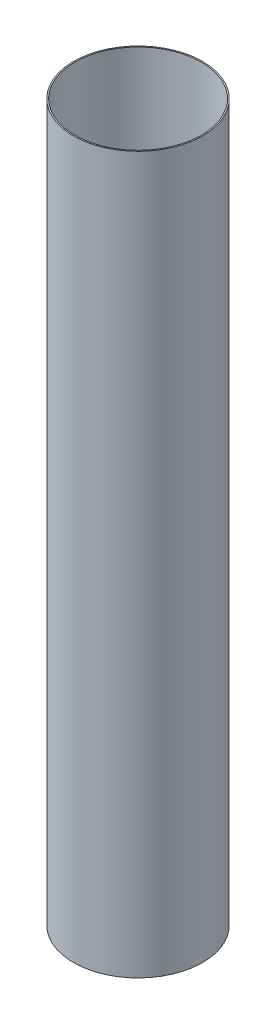
ISO-10303-21;
HEADER;
FILE_DESCRIPTION(('STEP AP214'),'2;1');
FILE_NAME('part.step','',(''),(''),'','','');
FILE_SCHEMA(('AUTOMOTIVE_DESIGN { 1 0 10303 214 1 1 1 1 }'));
ENDSEC;
DATA;
#1=APPLICATION_CONTEXT('core data for automotive mechanical design processes');
#2=APPLICATION_PROTOCOL_DEFINITION('international standard','automotive_design',2000,#1);
#3=PRODUCT_CONTEXT('',#1,'mechanical');
#4=PRODUCT('Part','Part','',(#3));
#5=PRODUCT_RELATED_PRODUCT_CATEGORY('part','',(#4));
#6=PRODUCT_DEFINITION_FORMATION('','',#4);
#7=PRODUCT_DEFINITION_CONTEXT('part definition',#1,'design');
#8=PRODUCT_DEFINITION('design','',#6,#7);
#9=PRODUCT_DEFINITION_SHAPE('','',#8);
#10=(LENGTH_UNIT() NAMED_UNIT(*) SI_UNIT(.MILLI.,.METRE.));
#11=(NAMED_UNIT(*) PLANE_ANGLE_UNIT() SI_UNIT($,.RADIAN.));
#12=(NAMED_UNIT(*) SI_UNIT($,.STERADIAN.) SOLID_ANGLE_UNIT());
#13=UNCERTAINTY_MEASURE_WITH_UNIT(LENGTH_MEASURE(1.E-05),#10,'distance_accuracy_value','');
#14=(GEOMETRIC_REPRESENTATION_CONTEXT(3) GLOBAL_UNCERTAINTY_ASSIGNED_CONTEXT((#13)) GLOBAL_UNIT_ASSIGNED_CONTEXT((#10,
#11,#12)) REPRESENTATION_CONTEXT('',''));
#15=CARTESIAN_POINT('',(0.,0.,0.));
#16=DIRECTION('',(0.,0.,1.));
#17=DIRECTION('',(1.,0.,0.));
#18=AXIS2_PLACEMENT_3D('',#15,#16,#17);
#19=CARTESIAN_POINT('',(0.,574.5988,0.));
#20=DIRECTION('',(0.,-1.,0.));
#21=DIRECTION('',(0.,0.,-1.));
#22=AXIS2_PLACEMENT_3D('',#19,#20,#21);
#23=CYLINDRICAL_SURFACE('',#22,50.8);
#24=CARTESIAN_POINT('',(0.,0.,0.));
#25=DIRECTION('',(0.,-1.,0.));
#26=DIRECTION('',(0.,0.,-1.));
#27=AXIS2_PLACEMENT_3D('',#24,#25,#26);
#28=CIRCLE('',#27,50.8);
#29=CARTESIAN_POINT('',(0.,0.,-50.8));
#30=VERTEX_POINT('',#29);
#31=EDGE_CURVE('E19',#30,#30,#28,.T.);
#32=ORIENTED_EDGE('',*,*,#31,.T.);
#33=EDGE_LOOP('',(#32));
#34=FACE_BOUND('',#33,.T.);
#35=CARTESIAN_POINT('',(0.,574.5988,0.));
#36=DIRECTION('',(0.,-1.,0.));
#37=DIRECTION('',(0.,0.,-1.));
#38=AXIS2_PLACEMENT_3D('',#35,#36,#37);
#39=CIRCLE('',#38,50.8);
#40=CARTESIAN_POINT('',(0.,574.5988,-50.8));
#41=VERTEX_POINT('',#40);
#42=EDGE_CURVE('E28',#41,#41,#39,.T.);
#43=ORIENTED_EDGE('',*,*,#42,.F.);
#44=EDGE_LOOP('',(#43));
#45=FACE_BOUND('',#44,.T.);
#46=ADVANCED_FACE('F15',(#34,#45),#23,.F.);
#47=CARTESIAN_POINT('',(-52.437792,0.,-52.437792));
#48=DIRECTION('',(0.,1.,0.));
#49=DIRECTION('',(0.,0.,1.));
#50=AXIS2_PLACEMENT_3D('',#47,#48,#49);
#51=PLANE('',#50);
#52=ORIENTED_EDGE('',*,*,#31,.F.);
#53=EDGE_LOOP('',(#52));
#54=FACE_BOUND('',#53,.T.);
#55=CARTESIAN_POINT('',(0.,0.,0.));
#56=DIRECTION('',(0.,-1.,0.));
#57=DIRECTION('',(0.,0.,-1.));
#58=AXIS2_PLACEMENT_3D('',#55,#56,#57);
#59=CIRCLE('',#58,51.816);
#60=CARTESIAN_POINT('',(0.,0.,-51.816));
#61=VERTEX_POINT('',#60);
#62=EDGE_CURVE('E23',#61,#61,#59,.T.);
#63=ORIENTED_EDGE('',*,*,#62,.T.);
#64=EDGE_LOOP('',(#63));
#65=FACE_BOUND('',#64,.T.);
#66=ADVANCED_FACE('F38',(#54,#65),#51,.F.);
#67=CARTESIAN_POINT('',(-52.437792,574.5988,-52.437792));
#68=DIRECTION('',(0.,1.,0.));
#69=DIRECTION('',(0.,0.,1.));
#70=AXIS2_PLACEMENT_3D('',#67,#68,#69);
#71=PLANE('',#70);
#72=ORIENTED_EDGE('',*,*,#42,.T.);
#73=EDGE_LOOP('',(#72));
#74=FACE_BOUND('',#73,.T.);
#75=CARTESIAN_POINT('',(0.,574.5988,0.));
#76=DIRECTION('',(0.,-1.,0.));
#77=DIRECTION('',(0.,0.,-1.));
#78=AXIS2_PLACEMENT_3D('',#75,#76,#77);
#79=CIRCLE('',#78,51.816);
#80=CARTESIAN_POINT('',(0.,574.5988,-51.816));
#81=VERTEX_POINT('',#80);
#82=EDGE_CURVE('E10',#81,#81,#79,.F.);
#83=ORIENTED_EDGE('',*,*,#82,.T.);
#84=EDGE_LOOP('',(#83));
#85=FACE_BOUND('',#84,.T.);
#86=ADVANCED_FACE('F17',(#74,#85),#71,.T.);
#87=CARTESIAN_POINT('',(0.,574.5988,0.));
#88=DIRECTION('',(0.,-1.,0.));
#89=DIRECTION('',(0.,0.,-1.));
#90=AXIS2_PLACEMENT_3D('',#87,#88,#89);
#91=CYLINDRICAL_SURFACE('',#90,51.816);
#92=ORIENTED_EDGE('',*,*,#62,.F.);
#93=EDGE_LOOP('',(#92));
#94=FACE_BOUND('',#93,.T.);
#95=ORIENTED_EDGE('',*,*,#82,.F.);
#96=EDGE_LOOP('',(#95));
#97=FACE_BOUND('',#96,.T.);
#98=ADVANCED_FACE('F43',(#94,#97),#91,.T.);
#99=CLOSED_SHELL('',(#46,#66,#86,#98));
#100=MANIFOLD_SOLID_BREP('B1',#99);
#101=ADVANCED_BREP_SHAPE_REPRESENTATION('',(#18,#100),#14);
#102=SHAPE_DEFINITION_REPRESENTATION(#9,#101);
ENDSEC;
END-ISO-10303-21;
